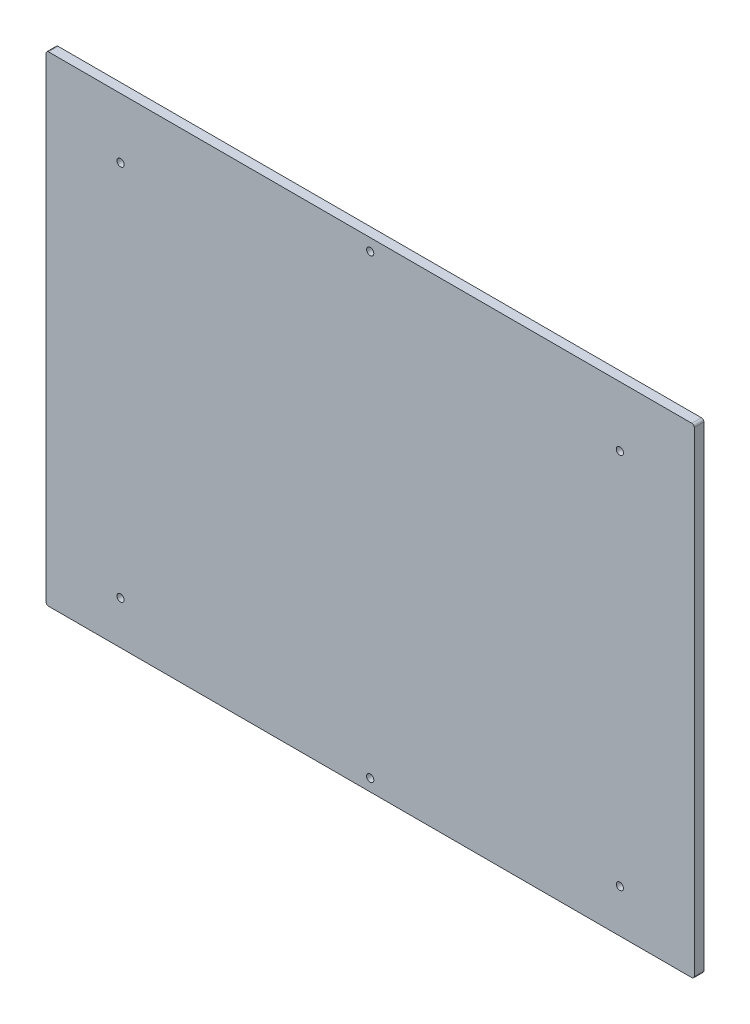
ISO-10303-21;
HEADER;
FILE_DESCRIPTION(('STEP AP214'),'2;1');
FILE_NAME('part.step','',(''),(''),'','','');
FILE_SCHEMA(('AUTOMOTIVE_DESIGN { 1 0 10303 214 1 1 1 1 }'));
ENDSEC;
DATA;
#1=APPLICATION_CONTEXT('core data for automotive mechanical design processes');
#2=APPLICATION_PROTOCOL_DEFINITION('international standard','automotive_design',2000,#1);
#3=PRODUCT_CONTEXT('',#1,'mechanical');
#4=PRODUCT('Part','Part','',(#3));
#5=PRODUCT_RELATED_PRODUCT_CATEGORY('part','',(#4));
#6=PRODUCT_DEFINITION_FORMATION('','',#4);
#7=PRODUCT_DEFINITION_CONTEXT('part definition',#1,'design');
#8=PRODUCT_DEFINITION('design','',#6,#7);
#9=PRODUCT_DEFINITION_SHAPE('','',#8);
#10=(LENGTH_UNIT() NAMED_UNIT(*) SI_UNIT(.MILLI.,.METRE.));
#11=(NAMED_UNIT(*) PLANE_ANGLE_UNIT() SI_UNIT($,.RADIAN.));
#12=(NAMED_UNIT(*) SI_UNIT($,.STERADIAN.) SOLID_ANGLE_UNIT());
#13=UNCERTAINTY_MEASURE_WITH_UNIT(LENGTH_MEASURE(1.E-05),#10,'distance_accuracy_value','');
#14=(GEOMETRIC_REPRESENTATION_CONTEXT(3) GLOBAL_UNCERTAINTY_ASSIGNED_CONTEXT((#13)) GLOBAL_UNIT_ASSIGNED_CONTEXT((#10,
#11,#12)) REPRESENTATION_CONTEXT('',''));
#15=CARTESIAN_POINT('',(0.,0.,0.));
#16=DIRECTION('',(0.,0.,1.));
#17=DIRECTION('',(1.,0.,0.));
#18=AXIS2_PLACEMENT_3D('',#15,#16,#17);
#19=CARTESIAN_POINT('',(135.,-100.,-4.));
#20=DIRECTION('',(1.,0.,0.));
#21=DIRECTION('',(0.,0.,-1.));
#22=AXIS2_PLACEMENT_3D('',#19,#20,#21);
#23=PLANE('',#22);
#24=DIRECTION('',(0.,1.,0.));
#25=VECTOR('',#24,1.);
#26=CARTESIAN_POINT('',(135.,-100.,-4.));
#27=LINE('',#26,#25);
#28=CARTESIAN_POINT('',(135.,-99.,-4.));
#29=VERTEX_POINT('',#28);
#30=CARTESIAN_POINT('',(135.,99.,-4.));
#31=VERTEX_POINT('',#30);
#32=EDGE_CURVE('E198',#29,#31,#27,.T.);
#33=ORIENTED_EDGE('',*,*,#32,.T.);
#34=DIRECTION('',(0.,0.,1.));
#35=VECTOR('',#34,1.);
#36=CARTESIAN_POINT('',(135.,99.,-4.));
#37=LINE('',#36,#35);
#38=CARTESIAN_POINT('',(135.,99.,0.));
#39=VERTEX_POINT('',#38);
#40=EDGE_CURVE('E127',#31,#39,#37,.T.);
#41=ORIENTED_EDGE('',*,*,#40,.T.);
#42=DIRECTION('',(0.,1.,0.));
#43=VECTOR('',#42,1.);
#44=CARTESIAN_POINT('',(135.,-100.,0.));
#45=LINE('',#44,#43);
#46=CARTESIAN_POINT('',(135.,-99.,0.));
#47=VERTEX_POINT('',#46);
#48=EDGE_CURVE('E111',#47,#39,#45,.T.);
#49=ORIENTED_EDGE('',*,*,#48,.F.);
#50=DIRECTION('',(0.,0.,1.));
#51=VECTOR('',#50,1.);
#52=CARTESIAN_POINT('',(135.,-99.,-4.));
#53=LINE('',#52,#51);
#54=EDGE_CURVE('E124',#47,#29,#53,.F.);
#55=ORIENTED_EDGE('',*,*,#54,.T.);
#56=EDGE_LOOP('',(#33,#41,#49,#55));
#57=FACE_BOUND('',#56,.T.);
#58=ADVANCED_FACE('F40',(#57),#23,.T.);
#59=CARTESIAN_POINT('',(-135.,-100.,-4.));
#60=DIRECTION('',(0.,-1.,0.));
#61=DIRECTION('',(0.,0.,-1.));
#62=AXIS2_PLACEMENT_3D('',#59,#60,#61);
#63=PLANE('',#62);
#64=DIRECTION('',(1.,0.,0.));
#65=VECTOR('',#64,1.);
#66=CARTESIAN_POINT('',(-135.,-100.,-4.));
#67=LINE('',#66,#65);
#68=CARTESIAN_POINT('',(-134.,-100.,-4.));
#69=VERTEX_POINT('',#68);
#70=CARTESIAN_POINT('',(134.,-100.,-4.));
#71=VERTEX_POINT('',#70);
#72=EDGE_CURVE('E134',#69,#71,#67,.T.);
#73=ORIENTED_EDGE('',*,*,#72,.T.);
#74=DIRECTION('',(0.,0.,1.));
#75=VECTOR('',#74,1.);
#76=CARTESIAN_POINT('',(134.,-100.,-4.));
#77=LINE('',#76,#75);
#78=CARTESIAN_POINT('',(134.,-100.,0.));
#79=VERTEX_POINT('',#78);
#80=EDGE_CURVE('E160',#71,#79,#77,.T.);
#81=ORIENTED_EDGE('',*,*,#80,.T.);
#82=DIRECTION('',(1.,0.,0.));
#83=VECTOR('',#82,1.);
#84=CARTESIAN_POINT('',(-135.,-100.,0.));
#85=LINE('',#84,#83);
#86=CARTESIAN_POINT('',(-134.,-100.,0.));
#87=VERTEX_POINT('',#86);
#88=EDGE_CURVE('E113',#87,#79,#85,.T.);
#89=ORIENTED_EDGE('',*,*,#88,.F.);
#90=DIRECTION('',(0.,0.,1.));
#91=VECTOR('',#90,1.);
#92=CARTESIAN_POINT('',(-134.,-100.,-4.));
#93=LINE('',#92,#91);
#94=EDGE_CURVE('E158',#87,#69,#93,.F.);
#95=ORIENTED_EDGE('',*,*,#94,.T.);
#96=EDGE_LOOP('',(#73,#81,#89,#95));
#97=FACE_BOUND('',#96,.T.);
#98=ADVANCED_FACE('F222',(#97),#63,.T.);
#99=CARTESIAN_POINT('',(-135.,-100.,-4.));
#100=DIRECTION('',(-1.,0.,0.));
#101=DIRECTION('',(0.,0.,1.));
#102=AXIS2_PLACEMENT_3D('',#99,#100,#101);
#103=PLANE('',#102);
#104=DIRECTION('',(0.,-1.,0.));
#105=VECTOR('',#104,1.);
#106=CARTESIAN_POINT('',(-135.,-100.,-4.));
#107=LINE('',#106,#105);
#108=CARTESIAN_POINT('',(-135.,99.,-4.));
#109=VERTEX_POINT('',#108);
#110=CARTESIAN_POINT('',(-135.,-99.,-4.));
#111=VERTEX_POINT('',#110);
#112=EDGE_CURVE('E139',#109,#111,#107,.T.);
#113=ORIENTED_EDGE('',*,*,#112,.T.);
#114=DIRECTION('',(0.,0.,1.));
#115=VECTOR('',#114,1.);
#116=CARTESIAN_POINT('',(-135.,-99.,-4.));
#117=LINE('',#116,#115);
#118=CARTESIAN_POINT('',(-135.,-99.,0.));
#119=VERTEX_POINT('',#118);
#120=EDGE_CURVE('E11',#111,#119,#117,.T.);
#121=ORIENTED_EDGE('',*,*,#120,.T.);
#122=DIRECTION('',(0.,-1.,0.));
#123=VECTOR('',#122,1.);
#124=CARTESIAN_POINT('',(-135.,-100.,0.));
#125=LINE('',#124,#123);
#126=CARTESIAN_POINT('',(-135.,99.,0.));
#127=VERTEX_POINT('',#126);
#128=EDGE_CURVE('E205',#127,#119,#125,.T.);
#129=ORIENTED_EDGE('',*,*,#128,.F.);
#130=DIRECTION('',(0.,0.,1.));
#131=VECTOR('',#130,1.);
#132=CARTESIAN_POINT('',(-135.,99.,-4.));
#133=LINE('',#132,#131);
#134=EDGE_CURVE('E49',#127,#109,#133,.F.);
#135=ORIENTED_EDGE('',*,*,#134,.T.);
#136=EDGE_LOOP('',(#113,#121,#129,#135));
#137=FACE_BOUND('',#136,.T.);
#138=ADVANCED_FACE('F207',(#137),#103,.T.);
#139=CARTESIAN_POINT('',(-135.,100.,-4.));
#140=DIRECTION('',(0.,1.,0.));
#141=DIRECTION('',(0.,0.,1.));
#142=AXIS2_PLACEMENT_3D('',#139,#140,#141);
#143=PLANE('',#142);
#144=DIRECTION('',(-1.,0.,0.));
#145=VECTOR('',#144,1.);
#146=CARTESIAN_POINT('',(-135.,100.,0.));
#147=LINE('',#146,#145);
#148=CARTESIAN_POINT('',(134.,100.,0.));
#149=VERTEX_POINT('',#148);
#150=CARTESIAN_POINT('',(-134.,100.,0.));
#151=VERTEX_POINT('',#150);
#152=EDGE_CURVE('E128',#149,#151,#147,.T.);
#153=ORIENTED_EDGE('',*,*,#152,.F.);
#154=DIRECTION('',(0.,0.,1.));
#155=VECTOR('',#154,1.);
#156=CARTESIAN_POINT('',(134.,100.,-4.));
#157=LINE('',#156,#155);
#158=CARTESIAN_POINT('',(134.,100.,-4.));
#159=VERTEX_POINT('',#158);
#160=EDGE_CURVE('E150',#149,#159,#157,.F.);
#161=ORIENTED_EDGE('',*,*,#160,.T.);
#162=DIRECTION('',(-1.,0.,0.));
#163=VECTOR('',#162,1.);
#164=CARTESIAN_POINT('',(-135.,100.,-4.));
#165=LINE('',#164,#163);
#166=CARTESIAN_POINT('',(-134.,100.,-4.));
#167=VERTEX_POINT('',#166);
#168=EDGE_CURVE('E200',#159,#167,#165,.T.);
#169=ORIENTED_EDGE('',*,*,#168,.T.);
#170=DIRECTION('',(0.,0.,1.));
#171=VECTOR('',#170,1.);
#172=CARTESIAN_POINT('',(-134.,100.,-4.));
#173=LINE('',#172,#171);
#174=EDGE_CURVE('E147',#167,#151,#173,.T.);
#175=ORIENTED_EDGE('',*,*,#174,.T.);
#176=EDGE_LOOP('',(#153,#161,#169,#175));
#177=FACE_BOUND('',#176,.T.);
#178=ADVANCED_FACE('F217',(#177),#143,.T.);
#179=CARTESIAN_POINT('',(0.,0.,-4.));
#180=DIRECTION('',(0.,0.,-1.));
#181=DIRECTION('',(-1.,0.,0.));
#182=AXIS2_PLACEMENT_3D('',#179,#180,#181);
#183=PLANE('',#182);
#184=CARTESIAN_POINT('',(-104.,-82.,-4.));
#185=DIRECTION('',(0.,0.,1.));
#186=DIRECTION('',(1.,0.,0.));
#187=AXIS2_PLACEMENT_3D('',#184,#185,#186);
#188=CIRCLE('',#187,1.5);
#189=CARTESIAN_POINT('',(-102.5,-82.,-4.));
#190=VERTEX_POINT('',#189);
#191=EDGE_CURVE('E183',#190,#190,#188,.T.);
#192=ORIENTED_EDGE('',*,*,#191,.T.);
#193=EDGE_LOOP('',(#192));
#194=FACE_BOUND('',#193,.T.);
#195=CARTESIAN_POINT('',(104.,-82.,-4.));
#196=DIRECTION('',(0.,0.,-1.));
#197=DIRECTION('',(-1.,0.,0.));
#198=AXIS2_PLACEMENT_3D('',#195,#196,#197);
#199=CIRCLE('',#198,1.5);
#200=CARTESIAN_POINT('',(102.5,-82.,-4.));
#201=VERTEX_POINT('',#200);
#202=EDGE_CURVE('E173',#201,#201,#199,.T.);
#203=ORIENTED_EDGE('',*,*,#202,.F.);
#204=EDGE_LOOP('',(#203));
#205=FACE_BOUND('',#204,.T.);
#206=CARTESIAN_POINT('',(-104.,75.,-4.));
#207=DIRECTION('',(0.,0.,1.));
#208=DIRECTION('',(1.,0.,0.));
#209=AXIS2_PLACEMENT_3D('',#206,#207,#208);
#210=CIRCLE('',#209,1.5);
#211=CARTESIAN_POINT('',(-102.5,75.,-4.));
#212=VERTEX_POINT('',#211);
#213=EDGE_CURVE('E170',#212,#212,#210,.T.);
#214=ORIENTED_EDGE('',*,*,#213,.T.);
#215=EDGE_LOOP('',(#214));
#216=FACE_BOUND('',#215,.T.);
#217=CARTESIAN_POINT('',(104.,75.,-4.));
#218=DIRECTION('',(0.,0.,-1.));
#219=DIRECTION('',(-1.,0.,0.));
#220=AXIS2_PLACEMENT_3D('',#217,#218,#219);
#221=CIRCLE('',#220,1.5);
#222=CARTESIAN_POINT('',(102.5,75.,-4.));
#223=VERTEX_POINT('',#222);
#224=EDGE_CURVE('E167',#223,#223,#221,.T.);
#225=ORIENTED_EDGE('',*,*,#224,.F.);
#226=EDGE_LOOP('',(#225));
#227=FACE_BOUND('',#226,.T.);
#228=CARTESIAN_POINT('',(0.,-95.,-4.));
#229=DIRECTION('',(0.,0.,-1.));
#230=DIRECTION('',(-1.,0.,0.));
#231=AXIS2_PLACEMENT_3D('',#228,#229,#230);
#232=CIRCLE('',#231,1.5);
#233=CARTESIAN_POINT('',(-1.5,-95.,-4.));
#234=VERTEX_POINT('',#233);
#235=EDGE_CURVE('E190',#234,#234,#232,.F.);
#236=ORIENTED_EDGE('',*,*,#235,.T.);
#237=EDGE_LOOP('',(#236));
#238=FACE_BOUND('',#237,.T.);
#239=CARTESIAN_POINT('',(0.,95.,-4.));
#240=DIRECTION('',(0.,0.,-1.));
#241=DIRECTION('',(-1.,0.,0.));
#242=AXIS2_PLACEMENT_3D('',#239,#240,#241);
#243=CIRCLE('',#242,1.5);
#244=CARTESIAN_POINT('',(-1.5,95.,-4.));
#245=VERTEX_POINT('',#244);
#246=EDGE_CURVE('E129',#245,#245,#243,.T.);
#247=ORIENTED_EDGE('',*,*,#246,.F.);
#248=EDGE_LOOP('',(#247));
#249=FACE_BOUND('',#248,.T.);
#250=ORIENTED_EDGE('',*,*,#168,.F.);
#251=CARTESIAN_POINT('',(134.,99.,-4.));
#252=DIRECTION('',(0.,0.,-1.));
#253=DIRECTION('',(-1.,0.,0.));
#254=AXIS2_PLACEMENT_3D('',#251,#252,#253);
#255=CIRCLE('',#254,1.);
#256=EDGE_CURVE('E156',#159,#31,#255,.T.);
#257=ORIENTED_EDGE('',*,*,#256,.T.);
#258=ORIENTED_EDGE('',*,*,#32,.F.);
#259=CARTESIAN_POINT('',(134.,-99.,-4.));
#260=DIRECTION('',(0.,0.,-1.));
#261=DIRECTION('',(-1.,0.,0.));
#262=AXIS2_PLACEMENT_3D('',#259,#260,#261);
#263=CIRCLE('',#262,1.);
#264=EDGE_CURVE('E133',#29,#71,#263,.T.);
#265=ORIENTED_EDGE('',*,*,#264,.T.);
#266=ORIENTED_EDGE('',*,*,#72,.F.);
#267=CARTESIAN_POINT('',(-134.,-99.,-4.));
#268=DIRECTION('',(0.,0.,-1.));
#269=DIRECTION('',(-1.,0.,0.));
#270=AXIS2_PLACEMENT_3D('',#267,#268,#269);
#271=CIRCLE('',#270,1.);
#272=EDGE_CURVE('E57',#69,#111,#271,.T.);
#273=ORIENTED_EDGE('',*,*,#272,.T.);
#274=ORIENTED_EDGE('',*,*,#112,.F.);
#275=CARTESIAN_POINT('',(-134.,99.,-4.));
#276=DIRECTION('',(0.,0.,-1.));
#277=DIRECTION('',(-1.,0.,0.));
#278=AXIS2_PLACEMENT_3D('',#275,#276,#277);
#279=CIRCLE('',#278,1.);
#280=EDGE_CURVE('E152',#109,#167,#279,.T.);
#281=ORIENTED_EDGE('',*,*,#280,.T.);
#282=EDGE_LOOP('',(#250,#257,#258,#265,#266,#273,#274,#281));
#283=FACE_BOUND('',#282,.T.);
#284=ADVANCED_FACE('F213',(#194,#205,#216,#227,#238,#249,#283),#183,.T.);
#285=CARTESIAN_POINT('',(0.,0.,0.));
#286=DIRECTION('',(0.,0.,-1.));
#287=DIRECTION('',(-1.,0.,0.));
#288=AXIS2_PLACEMENT_3D('',#285,#286,#287);
#289=PLANE('',#288);
#290=CARTESIAN_POINT('',(-104.,-82.,0.));
#291=DIRECTION('',(0.,0.,-1.));
#292=DIRECTION('',(-1.,0.,0.));
#293=AXIS2_PLACEMENT_3D('',#290,#291,#292);
#294=CIRCLE('',#293,1.5);
#295=CARTESIAN_POINT('',(-105.5,-82.,0.));
#296=VERTEX_POINT('',#295);
#297=EDGE_CURVE('E44',#296,#296,#294,.F.);
#298=ORIENTED_EDGE('',*,*,#297,.F.);
#299=EDGE_LOOP('',(#298));
#300=FACE_BOUND('',#299,.T.);
#301=CARTESIAN_POINT('',(104.,-82.,0.));
#302=DIRECTION('',(0.,0.,-1.));
#303=DIRECTION('',(-1.,0.,0.));
#304=AXIS2_PLACEMENT_3D('',#301,#302,#303);
#305=CIRCLE('',#304,1.5);
#306=CARTESIAN_POINT('',(102.5,-82.,0.));
#307=VERTEX_POINT('',#306);
#308=EDGE_CURVE('E171',#307,#307,#305,.T.);
#309=ORIENTED_EDGE('',*,*,#308,.T.);
#310=EDGE_LOOP('',(#309));
#311=FACE_BOUND('',#310,.T.);
#312=CARTESIAN_POINT('',(-104.,75.,0.));
#313=DIRECTION('',(0.,0.,-1.));
#314=DIRECTION('',(-1.,0.,0.));
#315=AXIS2_PLACEMENT_3D('',#312,#313,#314);
#316=CIRCLE('',#315,1.5);
#317=CARTESIAN_POINT('',(-105.5,75.,0.));
#318=VERTEX_POINT('',#317);
#319=EDGE_CURVE('E168',#318,#318,#316,.F.);
#320=ORIENTED_EDGE('',*,*,#319,.F.);
#321=EDGE_LOOP('',(#320));
#322=FACE_BOUND('',#321,.T.);
#323=CARTESIAN_POINT('',(104.,75.,0.));
#324=DIRECTION('',(0.,0.,-1.));
#325=DIRECTION('',(-1.,0.,0.));
#326=AXIS2_PLACEMENT_3D('',#323,#324,#325);
#327=CIRCLE('',#326,1.5);
#328=CARTESIAN_POINT('',(102.5,75.,0.));
#329=VERTEX_POINT('',#328);
#330=EDGE_CURVE('E163',#329,#329,#327,.T.);
#331=ORIENTED_EDGE('',*,*,#330,.T.);
#332=EDGE_LOOP('',(#331));
#333=FACE_BOUND('',#332,.T.);
#334=CARTESIAN_POINT('',(0.,-95.,0.));
#335=DIRECTION('',(0.,0.,-1.));
#336=DIRECTION('',(1.,0.,0.));
#337=AXIS2_PLACEMENT_3D('',#334,#335,#336);
#338=CIRCLE('',#337,1.5);
#339=CARTESIAN_POINT('',(1.5,-95.,0.));
#340=VERTEX_POINT('',#339);
#341=EDGE_CURVE('E166',#340,#340,#338,.T.);
#342=ORIENTED_EDGE('',*,*,#341,.T.);
#343=EDGE_LOOP('',(#342));
#344=FACE_BOUND('',#343,.T.);
#345=CARTESIAN_POINT('',(0.,95.,0.));
#346=DIRECTION('',(0.,0.,1.));
#347=DIRECTION('',(1.,0.,0.));
#348=AXIS2_PLACEMENT_3D('',#345,#346,#347);
#349=CIRCLE('',#348,1.5);
#350=CARTESIAN_POINT('',(1.5,95.,0.));
#351=VERTEX_POINT('',#350);
#352=EDGE_CURVE('E193',#351,#351,#349,.T.);
#353=ORIENTED_EDGE('',*,*,#352,.F.);
#354=EDGE_LOOP('',(#353));
#355=FACE_BOUND('',#354,.T.);
#356=ORIENTED_EDGE('',*,*,#48,.T.);
#357=CARTESIAN_POINT('',(134.,99.,0.));
#358=DIRECTION('',(0.,0.,-1.));
#359=DIRECTION('',(-1.,0.,0.));
#360=AXIS2_PLACEMENT_3D('',#357,#358,#359);
#361=CIRCLE('',#360,1.);
#362=EDGE_CURVE('E118',#39,#149,#361,.F.);
#363=ORIENTED_EDGE('',*,*,#362,.T.);
#364=ORIENTED_EDGE('',*,*,#152,.T.);
#365=CARTESIAN_POINT('',(-134.,99.,0.));
#366=DIRECTION('',(0.,0.,-1.));
#367=DIRECTION('',(-1.,0.,0.));
#368=AXIS2_PLACEMENT_3D('',#365,#366,#367);
#369=CIRCLE('',#368,1.);
#370=EDGE_CURVE('E136',#151,#127,#369,.F.);
#371=ORIENTED_EDGE('',*,*,#370,.T.);
#372=ORIENTED_EDGE('',*,*,#128,.T.);
#373=CARTESIAN_POINT('',(-134.,-99.,0.));
#374=DIRECTION('',(0.,0.,-1.));
#375=DIRECTION('',(-1.,0.,0.));
#376=AXIS2_PLACEMENT_3D('',#373,#374,#375);
#377=CIRCLE('',#376,1.);
#378=EDGE_CURVE('E119',#119,#87,#377,.F.);
#379=ORIENTED_EDGE('',*,*,#378,.T.);
#380=ORIENTED_EDGE('',*,*,#88,.T.);
#381=CARTESIAN_POINT('',(134.,-99.,0.));
#382=DIRECTION('',(0.,0.,-1.));
#383=DIRECTION('',(-1.,0.,0.));
#384=AXIS2_PLACEMENT_3D('',#381,#382,#383);
#385=CIRCLE('',#384,1.);
#386=EDGE_CURVE('E108',#79,#47,#385,.F.);
#387=ORIENTED_EDGE('',*,*,#386,.T.);
#388=EDGE_LOOP('',(#356,#363,#364,#371,#372,#379,#380,#387));
#389=FACE_BOUND('',#388,.T.);
#390=ADVANCED_FACE('F110',(#300,#311,#322,#333,#344,#355,#389),#289,.F.);
#391=CARTESIAN_POINT('',(0.,95.,-10.));
#392=DIRECTION('',(0.,0.,1.));
#393=DIRECTION('',(1.,0.,0.));
#394=AXIS2_PLACEMENT_3D('',#391,#392,#393);
#395=CYLINDRICAL_SURFACE('',#394,1.5);
#396=ORIENTED_EDGE('',*,*,#246,.T.);
#397=EDGE_LOOP('',(#396));
#398=FACE_BOUND('',#397,.T.);
#399=ORIENTED_EDGE('',*,*,#352,.T.);
#400=EDGE_LOOP('',(#399));
#401=FACE_BOUND('',#400,.T.);
#402=ADVANCED_FACE('F247',(#398,#401),#395,.F.);
#403=CARTESIAN_POINT('',(0.,-95.,-10.));
#404=DIRECTION('',(0.,0.,1.));
#405=DIRECTION('',(1.,0.,0.));
#406=AXIS2_PLACEMENT_3D('',#403,#404,#405);
#407=CYLINDRICAL_SURFACE('',#406,1.5);
#408=ORIENTED_EDGE('',*,*,#235,.F.);
#409=EDGE_LOOP('',(#408));
#410=FACE_BOUND('',#409,.T.);
#411=ORIENTED_EDGE('',*,*,#341,.F.);
#412=EDGE_LOOP('',(#411));
#413=FACE_BOUND('',#412,.T.);
#414=ADVANCED_FACE('F243',(#410,#413),#407,.F.);
#415=CARTESIAN_POINT('',(134.,99.,-4.));
#416=DIRECTION('',(0.,0.,1.));
#417=DIRECTION('',(1.,0.,0.));
#418=AXIS2_PLACEMENT_3D('',#415,#416,#417);
#419=CYLINDRICAL_SURFACE('',#418,1.);
#420=ORIENTED_EDGE('',*,*,#256,.F.);
#421=ORIENTED_EDGE('',*,*,#160,.F.);
#422=ORIENTED_EDGE('',*,*,#362,.F.);
#423=ORIENTED_EDGE('',*,*,#40,.F.);
#424=EDGE_LOOP('',(#420,#421,#422,#423));
#425=FACE_BOUND('',#424,.T.);
#426=ADVANCED_FACE('F220',(#425),#419,.T.);
#427=CARTESIAN_POINT('',(134.,-99.,-4.));
#428=DIRECTION('',(0.,0.,1.));
#429=DIRECTION('',(1.,0.,0.));
#430=AXIS2_PLACEMENT_3D('',#427,#428,#429);
#431=CYLINDRICAL_SURFACE('',#430,1.);
#432=ORIENTED_EDGE('',*,*,#264,.F.);
#433=ORIENTED_EDGE('',*,*,#54,.F.);
#434=ORIENTED_EDGE('',*,*,#386,.F.);
#435=ORIENTED_EDGE('',*,*,#80,.F.);
#436=EDGE_LOOP('',(#432,#433,#434,#435));
#437=FACE_BOUND('',#436,.T.);
#438=ADVANCED_FACE('F132',(#437),#431,.T.);
#439=CARTESIAN_POINT('',(-134.,-99.,-4.));
#440=DIRECTION('',(0.,0.,1.));
#441=DIRECTION('',(1.,0.,0.));
#442=AXIS2_PLACEMENT_3D('',#439,#440,#441);
#443=CYLINDRICAL_SURFACE('',#442,1.);
#444=ORIENTED_EDGE('',*,*,#272,.F.);
#445=ORIENTED_EDGE('',*,*,#94,.F.);
#446=ORIENTED_EDGE('',*,*,#378,.F.);
#447=ORIENTED_EDGE('',*,*,#120,.F.);
#448=EDGE_LOOP('',(#444,#445,#446,#447));
#449=FACE_BOUND('',#448,.T.);
#450=ADVANCED_FACE('F225',(#449),#443,.T.);
#451=CARTESIAN_POINT('',(-134.,99.,-4.));
#452=DIRECTION('',(0.,0.,1.));
#453=DIRECTION('',(1.,0.,0.));
#454=AXIS2_PLACEMENT_3D('',#451,#452,#453);
#455=CYLINDRICAL_SURFACE('',#454,1.);
#456=ORIENTED_EDGE('',*,*,#280,.F.);
#457=ORIENTED_EDGE('',*,*,#134,.F.);
#458=ORIENTED_EDGE('',*,*,#370,.F.);
#459=ORIENTED_EDGE('',*,*,#174,.F.);
#460=EDGE_LOOP('',(#456,#457,#458,#459));
#461=FACE_BOUND('',#460,.T.);
#462=ADVANCED_FACE('F42',(#461),#455,.T.);
#463=CARTESIAN_POINT('',(104.,75.,6.));
#464=DIRECTION('',(0.,0.,-1.));
#465=DIRECTION('',(-1.,0.,0.));
#466=AXIS2_PLACEMENT_3D('',#463,#464,#465);
#467=CYLINDRICAL_SURFACE('',#466,1.5);
#468=ORIENTED_EDGE('',*,*,#224,.T.);
#469=EDGE_LOOP('',(#468));
#470=FACE_BOUND('',#469,.T.);
#471=ORIENTED_EDGE('',*,*,#330,.F.);
#472=EDGE_LOOP('',(#471));
#473=FACE_BOUND('',#472,.T.);
#474=ADVANCED_FACE('F231',(#470,#473),#467,.F.);
#475=CARTESIAN_POINT('',(-104.,75.,6.));
#476=DIRECTION('',(0.,0.,-1.));
#477=DIRECTION('',(-1.,0.,0.));
#478=AXIS2_PLACEMENT_3D('',#475,#476,#477);
#479=CYLINDRICAL_SURFACE('',#478,1.5);
#480=ORIENTED_EDGE('',*,*,#213,.F.);
#481=EDGE_LOOP('',(#480));
#482=FACE_BOUND('',#481,.T.);
#483=ORIENTED_EDGE('',*,*,#319,.T.);
#484=EDGE_LOOP('',(#483));
#485=FACE_BOUND('',#484,.T.);
#486=ADVANCED_FACE('F333',(#482,#485),#479,.F.);
#487=CARTESIAN_POINT('',(104.,-82.,6.));
#488=DIRECTION('',(0.,0.,-1.));
#489=DIRECTION('',(-1.,0.,0.));
#490=AXIS2_PLACEMENT_3D('',#487,#488,#489);
#491=CYLINDRICAL_SURFACE('',#490,1.5);
#492=ORIENTED_EDGE('',*,*,#202,.T.);
#493=EDGE_LOOP('',(#492));
#494=FACE_BOUND('',#493,.T.);
#495=ORIENTED_EDGE('',*,*,#308,.F.);
#496=EDGE_LOOP('',(#495));
#497=FACE_BOUND('',#496,.T.);
#498=ADVANCED_FACE('F343',(#494,#497),#491,.F.);
#499=CARTESIAN_POINT('',(-104.,-82.,6.));
#500=DIRECTION('',(0.,0.,-1.));
#501=DIRECTION('',(-1.,0.,0.));
#502=AXIS2_PLACEMENT_3D('',#499,#500,#501);
#503=CYLINDRICAL_SURFACE('',#502,1.5);
#504=ORIENTED_EDGE('',*,*,#191,.F.);
#505=EDGE_LOOP('',(#504));
#506=FACE_BOUND('',#505,.T.);
#507=ORIENTED_EDGE('',*,*,#297,.T.);
#508=EDGE_LOOP('',(#507));
#509=FACE_BOUND('',#508,.T.);
#510=ADVANCED_FACE('F352',(#506,#509),#503,.F.);
#511=CLOSED_SHELL('',(#58,#98,#138,#178,#284,#390,#402,#414,#426,#438,#450,#462,#474,#486,#498,#510));
#512=MANIFOLD_SOLID_BREP('B2',#511);
#513=ADVANCED_BREP_SHAPE_REPRESENTATION('',(#18,#512),#14);
#514=SHAPE_DEFINITION_REPRESENTATION(#9,#513);
ENDSEC;
END-ISO-10303-21;
